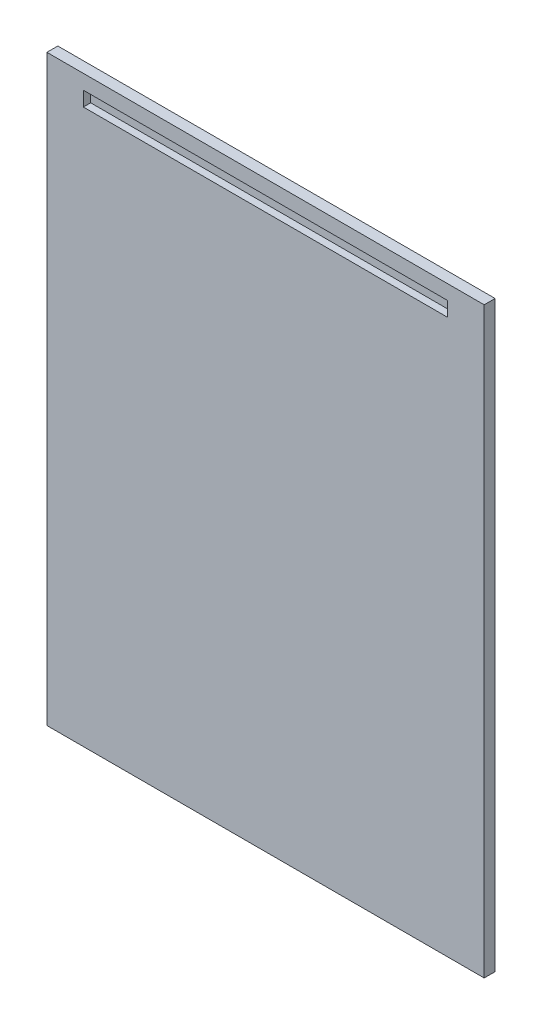
ISO-10303-21;
HEADER;
FILE_DESCRIPTION(('STEP AP214'),'2;1');
FILE_NAME('part.step','',(''),(''),'','','');
FILE_SCHEMA(('AUTOMOTIVE_DESIGN { 1 0 10303 214 1 1 1 1 }'));
ENDSEC;
DATA;
#1=APPLICATION_CONTEXT('core data for automotive mechanical design processes');
#2=APPLICATION_PROTOCOL_DEFINITION('international standard','automotive_design',2000,#1);
#3=PRODUCT_CONTEXT('',#1,'mechanical');
#4=PRODUCT('Part','Part','',(#3));
#5=PRODUCT_RELATED_PRODUCT_CATEGORY('part','',(#4));
#6=PRODUCT_DEFINITION_FORMATION('','',#4);
#7=PRODUCT_DEFINITION_CONTEXT('part definition',#1,'design');
#8=PRODUCT_DEFINITION('design','',#6,#7);
#9=PRODUCT_DEFINITION_SHAPE('','',#8);
#10=(LENGTH_UNIT() NAMED_UNIT(*) SI_UNIT(.MILLI.,.METRE.));
#11=(NAMED_UNIT(*) PLANE_ANGLE_UNIT() SI_UNIT($,.RADIAN.));
#12=(NAMED_UNIT(*) SI_UNIT($,.STERADIAN.) SOLID_ANGLE_UNIT());
#13=UNCERTAINTY_MEASURE_WITH_UNIT(LENGTH_MEASURE(1.E-05),#10,'distance_accuracy_value','');
#14=(GEOMETRIC_REPRESENTATION_CONTEXT(3) GLOBAL_UNCERTAINTY_ASSIGNED_CONTEXT((#13)) GLOBAL_UNIT_ASSIGNED_CONTEXT((#10,
#11,#12)) REPRESENTATION_CONTEXT('',''));
#15=CARTESIAN_POINT('',(0.,0.,0.));
#16=DIRECTION('',(0.,0.,1.));
#17=DIRECTION('',(1.,0.,0.));
#18=AXIS2_PLACEMENT_3D('',#15,#16,#17);
#19=CARTESIAN_POINT('',(300.,-400.,15.));
#20=DIRECTION('',(-1.,0.,0.));
#21=DIRECTION('',(0.,0.,1.));
#22=AXIS2_PLACEMENT_3D('',#19,#20,#21);
#23=PLANE('',#22);
#24=DIRECTION('',(0.,1.,0.));
#25=VECTOR('',#24,1.);
#26=CARTESIAN_POINT('',(300.,-400.,0.));
#27=LINE('',#26,#25);
#28=CARTESIAN_POINT('',(300.,-400.,0.));
#29=VERTEX_POINT('',#28);
#30=CARTESIAN_POINT('',(300.,400.,0.));
#31=VERTEX_POINT('',#30);
#32=EDGE_CURVE('E162',#29,#31,#27,.T.);
#33=ORIENTED_EDGE('',*,*,#32,.T.);
#34=DIRECTION('',(0.,0.,-1.));
#35=VECTOR('',#34,1.);
#36=CARTESIAN_POINT('',(300.,400.,15.));
#37=LINE('',#36,#35);
#38=CARTESIAN_POINT('',(300.,400.,15.));
#39=VERTEX_POINT('',#38);
#40=EDGE_CURVE('E11',#39,#31,#37,.T.);
#41=ORIENTED_EDGE('',*,*,#40,.F.);
#42=DIRECTION('',(0.,1.,0.));
#43=VECTOR('',#42,1.);
#44=CARTESIAN_POINT('',(300.,-400.,15.));
#45=LINE('',#44,#43);
#46=CARTESIAN_POINT('',(300.,-400.,15.));
#47=VERTEX_POINT('',#46);
#48=EDGE_CURVE('E168',#47,#39,#45,.T.);
#49=ORIENTED_EDGE('',*,*,#48,.F.);
#50=DIRECTION('',(0.,0.,-1.));
#51=VECTOR('',#50,1.);
#52=CARTESIAN_POINT('',(300.,-400.,15.));
#53=LINE('',#52,#51);
#54=EDGE_CURVE('E178',#47,#29,#53,.T.);
#55=ORIENTED_EDGE('',*,*,#54,.T.);
#56=EDGE_LOOP('',(#33,#41,#49,#55));
#57=FACE_BOUND('',#56,.T.);
#58=ADVANCED_FACE('F43',(#57),#23,.F.);
#59=CARTESIAN_POINT('',(-300.,400.,15.));
#60=DIRECTION('',(0.,-1.,0.));
#61=DIRECTION('',(0.,0.,-1.));
#62=AXIS2_PLACEMENT_3D('',#59,#60,#61);
#63=PLANE('',#62);
#64=DIRECTION('',(-1.,0.,0.));
#65=VECTOR('',#64,1.);
#66=CARTESIAN_POINT('',(-300.,400.,0.));
#67=LINE('',#66,#65);
#68=CARTESIAN_POINT('',(-300.,400.,0.));
#69=VERTEX_POINT('',#68);
#70=EDGE_CURVE('E182',#31,#69,#67,.T.);
#71=ORIENTED_EDGE('',*,*,#70,.T.);
#72=DIRECTION('',(0.,0.,-1.));
#73=VECTOR('',#72,1.);
#74=CARTESIAN_POINT('',(-300.,400.,15.));
#75=LINE('',#74,#73);
#76=CARTESIAN_POINT('',(-300.,400.,15.));
#77=VERTEX_POINT('',#76);
#78=EDGE_CURVE('E51',#77,#69,#75,.T.);
#79=ORIENTED_EDGE('',*,*,#78,.F.);
#80=DIRECTION('',(-1.,0.,0.));
#81=VECTOR('',#80,1.);
#82=CARTESIAN_POINT('',(-300.,400.,15.));
#83=LINE('',#82,#81);
#84=EDGE_CURVE('E95',#39,#77,#83,.T.);
#85=ORIENTED_EDGE('',*,*,#84,.F.);
#86=ORIENTED_EDGE('',*,*,#40,.T.);
#87=EDGE_LOOP('',(#71,#79,#85,#86));
#88=FACE_BOUND('',#87,.T.);
#89=ADVANCED_FACE('F217',(#88),#63,.F.);
#90=CARTESIAN_POINT('',(-300.,-400.,15.));
#91=DIRECTION('',(1.,0.,0.));
#92=DIRECTION('',(0.,0.,-1.));
#93=AXIS2_PLACEMENT_3D('',#90,#91,#92);
#94=PLANE('',#93);
#95=DIRECTION('',(0.,-1.,0.));
#96=VECTOR('',#95,1.);
#97=CARTESIAN_POINT('',(-300.,-400.,0.));
#98=LINE('',#97,#96);
#99=CARTESIAN_POINT('',(-300.,-400.,0.));
#100=VERTEX_POINT('',#99);
#101=EDGE_CURVE('E185',#69,#100,#98,.T.);
#102=ORIENTED_EDGE('',*,*,#101,.T.);
#103=DIRECTION('',(0.,0.,-1.));
#104=VECTOR('',#103,1.);
#105=CARTESIAN_POINT('',(-300.,-400.,15.));
#106=LINE('',#105,#104);
#107=CARTESIAN_POINT('',(-300.,-400.,15.));
#108=VERTEX_POINT('',#107);
#109=EDGE_CURVE('E192',#108,#100,#106,.T.);
#110=ORIENTED_EDGE('',*,*,#109,.F.);
#111=DIRECTION('',(0.,-1.,0.));
#112=VECTOR('',#111,1.);
#113=CARTESIAN_POINT('',(-300.,-400.,15.));
#114=LINE('',#113,#112);
#115=EDGE_CURVE('E173',#77,#108,#114,.T.);
#116=ORIENTED_EDGE('',*,*,#115,.F.);
#117=ORIENTED_EDGE('',*,*,#78,.T.);
#118=EDGE_LOOP('',(#102,#110,#116,#117));
#119=FACE_BOUND('',#118,.T.);
#120=ADVANCED_FACE('F199',(#119),#94,.F.);
#121=CARTESIAN_POINT('',(-300.,-400.,15.));
#122=DIRECTION('',(0.,1.,0.));
#123=DIRECTION('',(0.,0.,1.));
#124=AXIS2_PLACEMENT_3D('',#121,#122,#123);
#125=PLANE('',#124);
#126=DIRECTION('',(1.,0.,0.));
#127=VECTOR('',#126,1.);
#128=CARTESIAN_POINT('',(-300.,-400.,0.));
#129=LINE('',#128,#127);
#130=EDGE_CURVE('E88',#100,#29,#129,.T.);
#131=ORIENTED_EDGE('',*,*,#130,.T.);
#132=ORIENTED_EDGE('',*,*,#54,.F.);
#133=DIRECTION('',(1.,0.,0.));
#134=VECTOR('',#133,1.);
#135=CARTESIAN_POINT('',(-300.,-400.,15.));
#136=LINE('',#135,#134);
#137=EDGE_CURVE('E67',#108,#47,#136,.T.);
#138=ORIENTED_EDGE('',*,*,#137,.F.);
#139=ORIENTED_EDGE('',*,*,#109,.T.);
#140=EDGE_LOOP('',(#131,#132,#138,#139));
#141=FACE_BOUND('',#140,.T.);
#142=ADVANCED_FACE('F207',(#141),#125,.F.);
#143=CARTESIAN_POINT('',(0.,0.,15.));
#144=DIRECTION('',(0.,0.,-1.));
#145=DIRECTION('',(-1.,0.,0.));
#146=AXIS2_PLACEMENT_3D('',#143,#144,#145);
#147=PLANE('',#146);
#148=DIRECTION('',(-1.,0.,0.));
#149=VECTOR('',#148,1.);
#150=CARTESIAN_POINT('',(-250.,380.,15.));
#151=LINE('',#150,#149);
#152=CARTESIAN_POINT('',(250.,380.,15.));
#153=VERTEX_POINT('',#152);
#154=CARTESIAN_POINT('',(-250.,380.,15.));
#155=VERTEX_POINT('',#154);
#156=EDGE_CURVE('E153',#153,#155,#151,.T.);
#157=ORIENTED_EDGE('',*,*,#156,.F.);
#158=DIRECTION('',(0.,1.,0.));
#159=VECTOR('',#158,1.);
#160=CARTESIAN_POINT('',(250.,360.,15.));
#161=LINE('',#160,#159);
#162=CARTESIAN_POINT('',(250.,360.,15.));
#163=VERTEX_POINT('',#162);
#164=EDGE_CURVE('E58',#163,#153,#161,.T.);
#165=ORIENTED_EDGE('',*,*,#164,.F.);
#166=DIRECTION('',(1.,0.,0.));
#167=VECTOR('',#166,1.);
#168=CARTESIAN_POINT('',(-250.,360.,15.));
#169=LINE('',#168,#167);
#170=CARTESIAN_POINT('',(-250.,360.,15.));
#171=VERTEX_POINT('',#170);
#172=EDGE_CURVE('E140',#171,#163,#169,.T.);
#173=ORIENTED_EDGE('',*,*,#172,.F.);
#174=DIRECTION('',(0.,-1.,0.));
#175=VECTOR('',#174,1.);
#176=CARTESIAN_POINT('',(-250.,360.,15.));
#177=LINE('',#176,#175);
#178=EDGE_CURVE('E144',#155,#171,#177,.T.);
#179=ORIENTED_EDGE('',*,*,#178,.F.);
#180=EDGE_LOOP('',(#157,#165,#173,#179));
#181=FACE_BOUND('',#180,.T.);
#182=ORIENTED_EDGE('',*,*,#48,.T.);
#183=ORIENTED_EDGE('',*,*,#84,.T.);
#184=ORIENTED_EDGE('',*,*,#115,.T.);
#185=ORIENTED_EDGE('',*,*,#137,.T.);
#186=EDGE_LOOP('',(#182,#183,#184,#185));
#187=FACE_BOUND('',#186,.T.);
#188=ADVANCED_FACE('F209',(#181,#187),#147,.F.);
#189=CARTESIAN_POINT('',(0.,0.,0.));
#190=DIRECTION('',(0.,0.,-1.));
#191=DIRECTION('',(-1.,0.,0.));
#192=AXIS2_PLACEMENT_3D('',#189,#190,#191);
#193=PLANE('',#192);
#194=ORIENTED_EDGE('',*,*,#32,.F.);
#195=ORIENTED_EDGE('',*,*,#130,.F.);
#196=ORIENTED_EDGE('',*,*,#101,.F.);
#197=ORIENTED_EDGE('',*,*,#70,.F.);
#198=EDGE_LOOP('',(#194,#195,#196,#197));
#199=FACE_BOUND('',#198,.T.);
#200=ADVANCED_FACE('F203',(#199),#193,.T.);
#201=CARTESIAN_POINT('',(250.,360.,5.));
#202=DIRECTION('',(1.,0.,0.));
#203=DIRECTION('',(0.,1.,0.));
#204=AXIS2_PLACEMENT_3D('',#201,#202,#203);
#205=PLANE('',#204);
#206=ORIENTED_EDGE('',*,*,#164,.T.);
#207=DIRECTION('',(0.,0.,1.));
#208=VECTOR('',#207,1.);
#209=CARTESIAN_POINT('',(250.,380.,5.));
#210=LINE('',#209,#208);
#211=CARTESIAN_POINT('',(250.,380.,5.));
#212=VERTEX_POINT('',#211);
#213=EDGE_CURVE('E115',#212,#153,#210,.T.);
#214=ORIENTED_EDGE('',*,*,#213,.F.);
#215=DIRECTION('',(0.,1.,0.));
#216=VECTOR('',#215,1.);
#217=CARTESIAN_POINT('',(250.,360.,5.));
#218=LINE('',#217,#216);
#219=CARTESIAN_POINT('',(250.,360.,5.));
#220=VERTEX_POINT('',#219);
#221=EDGE_CURVE('E119',#220,#212,#218,.T.);
#222=ORIENTED_EDGE('',*,*,#221,.F.);
#223=DIRECTION('',(0.,0.,1.));
#224=VECTOR('',#223,1.);
#225=CARTESIAN_POINT('',(250.,360.,5.));
#226=LINE('',#225,#224);
#227=EDGE_CURVE('E159',#220,#163,#226,.T.);
#228=ORIENTED_EDGE('',*,*,#227,.T.);
#229=EDGE_LOOP('',(#206,#214,#222,#228));
#230=FACE_BOUND('',#229,.T.);
#231=ADVANCED_FACE('F117',(#230),#205,.F.);
#232=CARTESIAN_POINT('',(-250.,360.,5.));
#233=DIRECTION('',(0.,-1.,0.));
#234=DIRECTION('',(0.,0.,-1.));
#235=AXIS2_PLACEMENT_3D('',#232,#233,#234);
#236=PLANE('',#235);
#237=ORIENTED_EDGE('',*,*,#172,.T.);
#238=ORIENTED_EDGE('',*,*,#227,.F.);
#239=DIRECTION('',(1.,0.,0.));
#240=VECTOR('',#239,1.);
#241=CARTESIAN_POINT('',(-250.,360.,5.));
#242=LINE('',#241,#240);
#243=CARTESIAN_POINT('',(-250.,360.,5.));
#244=VERTEX_POINT('',#243);
#245=EDGE_CURVE('E126',#244,#220,#242,.T.);
#246=ORIENTED_EDGE('',*,*,#245,.F.);
#247=DIRECTION('',(0.,0.,1.));
#248=VECTOR('',#247,1.);
#249=CARTESIAN_POINT('',(-250.,360.,5.));
#250=LINE('',#249,#248);
#251=EDGE_CURVE('E163',#244,#171,#250,.T.);
#252=ORIENTED_EDGE('',*,*,#251,.T.);
#253=EDGE_LOOP('',(#237,#238,#246,#252));
#254=FACE_BOUND('',#253,.T.);
#255=ADVANCED_FACE('F260',(#254),#236,.F.);
#256=CARTESIAN_POINT('',(-250.,360.,5.));
#257=DIRECTION('',(-1.,0.,0.));
#258=DIRECTION('',(0.,0.,1.));
#259=AXIS2_PLACEMENT_3D('',#256,#257,#258);
#260=PLANE('',#259);
#261=ORIENTED_EDGE('',*,*,#178,.T.);
#262=ORIENTED_EDGE('',*,*,#251,.F.);
#263=DIRECTION('',(0.,-1.,0.));
#264=VECTOR('',#263,1.);
#265=CARTESIAN_POINT('',(-250.,360.,5.));
#266=LINE('',#265,#264);
#267=CARTESIAN_POINT('',(-250.,380.,5.));
#268=VERTEX_POINT('',#267);
#269=EDGE_CURVE('E135',#268,#244,#266,.T.);
#270=ORIENTED_EDGE('',*,*,#269,.F.);
#271=DIRECTION('',(0.,0.,1.));
#272=VECTOR('',#271,1.);
#273=CARTESIAN_POINT('',(-250.,380.,5.));
#274=LINE('',#273,#272);
#275=EDGE_CURVE('E125',#268,#155,#274,.T.);
#276=ORIENTED_EDGE('',*,*,#275,.T.);
#277=EDGE_LOOP('',(#261,#262,#270,#276));
#278=FACE_BOUND('',#277,.T.);
#279=ADVANCED_FACE('F270',(#278),#260,.F.);
#280=CARTESIAN_POINT('',(-250.,380.,5.));
#281=DIRECTION('',(0.,1.,0.));
#282=DIRECTION('',(0.,0.,1.));
#283=AXIS2_PLACEMENT_3D('',#280,#281,#282);
#284=PLANE('',#283);
#285=ORIENTED_EDGE('',*,*,#156,.T.);
#286=ORIENTED_EDGE('',*,*,#275,.F.);
#287=DIRECTION('',(-1.,0.,0.));
#288=VECTOR('',#287,1.);
#289=CARTESIAN_POINT('',(-250.,380.,5.));
#290=LINE('',#289,#288);
#291=EDGE_CURVE('E129',#212,#268,#290,.T.);
#292=ORIENTED_EDGE('',*,*,#291,.F.);
#293=ORIENTED_EDGE('',*,*,#213,.T.);
#294=EDGE_LOOP('',(#285,#286,#292,#293));
#295=FACE_BOUND('',#294,.T.);
#296=ADVANCED_FACE('F130',(#295),#284,.F.);
#297=CARTESIAN_POINT('',(0.,0.,5.));
#298=DIRECTION('',(0.,0.,-1.));
#299=DIRECTION('',(-1.,0.,0.));
#300=AXIS2_PLACEMENT_3D('',#297,#298,#299);
#301=PLANE('',#300);
#302=ORIENTED_EDGE('',*,*,#221,.T.);
#303=ORIENTED_EDGE('',*,*,#291,.T.);
#304=ORIENTED_EDGE('',*,*,#269,.T.);
#305=ORIENTED_EDGE('',*,*,#245,.T.);
#306=EDGE_LOOP('',(#302,#303,#304,#305));
#307=FACE_BOUND('',#306,.T.);
#308=ADVANCED_FACE('F137',(#307),#301,.F.);
#309=CLOSED_SHELL('',(#58,#89,#120,#142,#188,#200,#231,#255,#279,#296,#308));
#310=MANIFOLD_SOLID_BREP('B2',#309);
#311=ADVANCED_BREP_SHAPE_REPRESENTATION('',(#18,#310),#14);
#312=SHAPE_DEFINITION_REPRESENTATION(#9,#311);
ENDSEC;
END-ISO-10303-21;
